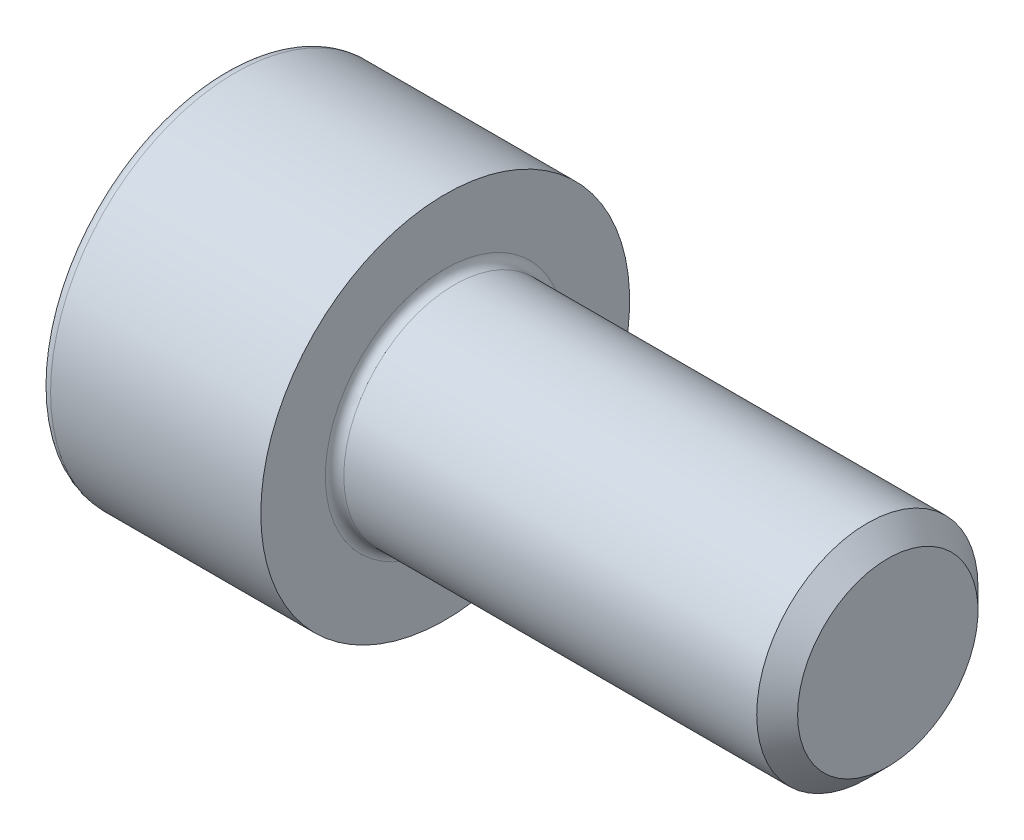
ISO-10303-21;
HEADER;
FILE_DESCRIPTION(('STEP AP214'),'2;1');
FILE_NAME('part.step','',(''),(''),'','','');
FILE_SCHEMA(('AUTOMOTIVE_DESIGN { 1 0 10303 214 1 1 1 1 }'));
ENDSEC;
DATA;
#1=APPLICATION_CONTEXT('core data for automotive mechanical design processes');
#2=APPLICATION_PROTOCOL_DEFINITION('international standard','automotive_design',2000,#1);
#3=PRODUCT_CONTEXT('',#1,'mechanical');
#4=PRODUCT('Part','Part','',(#3));
#5=PRODUCT_RELATED_PRODUCT_CATEGORY('part','',(#4));
#6=PRODUCT_DEFINITION_FORMATION('','',#4);
#7=PRODUCT_DEFINITION_CONTEXT('part definition',#1,'design');
#8=PRODUCT_DEFINITION('design','',#6,#7);
#9=PRODUCT_DEFINITION_SHAPE('','',#8);
#10=(LENGTH_UNIT() NAMED_UNIT(*) SI_UNIT(.MILLI.,.METRE.));
#11=(NAMED_UNIT(*) PLANE_ANGLE_UNIT() SI_UNIT($,.RADIAN.));
#12=(NAMED_UNIT(*) SI_UNIT($,.STERADIAN.) SOLID_ANGLE_UNIT());
#13=UNCERTAINTY_MEASURE_WITH_UNIT(LENGTH_MEASURE(1.E-05),#10,'distance_accuracy_value','');
#14=(GEOMETRIC_REPRESENTATION_CONTEXT(3) GLOBAL_UNCERTAINTY_ASSIGNED_CONTEXT((#13)) GLOBAL_UNIT_ASSIGNED_CONTEXT((#10,
#11,#12)) REPRESENTATION_CONTEXT('',''));
#15=CARTESIAN_POINT('',(0.,0.,0.));
#16=DIRECTION('',(0.,0.,1.));
#17=DIRECTION('',(1.,0.,0.));
#18=AXIS2_PLACEMENT_3D('',#15,#16,#17);
#19=CARTESIAN_POINT('',(0.,0.,0.));
#20=DIRECTION('',(-1.,0.,0.));
#21=DIRECTION('',(0.,0.,1.));
#22=AXIS2_PLACEMENT_3D('',#19,#20,#21);
#23=PLANE('',#22);
#24=DIRECTION('',(0.,-0.499999999999999,0.866025403784439));
#25=VECTOR('',#24,1.);
#26=CARTESIAN_POINT('',(0.,2.93524876856006,0.));
#27=LINE('',#26,#25);
#28=CARTESIAN_POINT('',(0.,2.93524876856006,0.));
#29=VERTEX_POINT('',#28);
#30=CARTESIAN_POINT('',(0.,1.46762438428003,2.542));
#31=VERTEX_POINT('',#30);
#32=EDGE_CURVE('E262',#29,#31,#27,.T.);
#33=ORIENTED_EDGE('',*,*,#32,.T.);
#34=DIRECTION('',(0.,1.,0.));
#35=VECTOR('',#34,1.);
#36=CARTESIAN_POINT('',(0.,-1.46762438428003,2.542));
#37=LINE('',#36,#35);
#38=CARTESIAN_POINT('',(0.,-1.46762438428003,2.542));
#39=VERTEX_POINT('',#38);
#40=EDGE_CURVE('E134',#39,#31,#37,.T.);
#41=ORIENTED_EDGE('',*,*,#40,.F.);
#42=DIRECTION('',(0.,-0.500000000000001,-0.866025403784438));
#43=VECTOR('',#42,1.);
#44=CARTESIAN_POINT('',(0.,-1.46762438428003,2.542));
#45=LINE('',#44,#43);
#46=CARTESIAN_POINT('',(0.,-2.93524876856006,0.));
#47=VERTEX_POINT('',#46);
#48=EDGE_CURVE('E265',#39,#47,#45,.T.);
#49=ORIENTED_EDGE('',*,*,#48,.T.);
#50=DIRECTION('',(0.,0.499999999999999,-0.866025403784439));
#51=VECTOR('',#50,1.);
#52=CARTESIAN_POINT('',(0.,-2.93524876856006,0.));
#53=LINE('',#52,#51);
#54=CARTESIAN_POINT('',(0.,-1.46762438428004,-2.542));
#55=VERTEX_POINT('',#54);
#56=EDGE_CURVE('E268',#47,#55,#53,.T.);
#57=ORIENTED_EDGE('',*,*,#56,.T.);
#58=DIRECTION('',(0.,-1.,0.));
#59=VECTOR('',#58,1.);
#60=CARTESIAN_POINT('',(0.,1.46762438428002,-2.542));
#61=LINE('',#60,#59);
#62=CARTESIAN_POINT('',(0.,1.46762438428002,-2.542));
#63=VERTEX_POINT('',#62);
#64=EDGE_CURVE('E271',#63,#55,#61,.T.);
#65=ORIENTED_EDGE('',*,*,#64,.F.);
#66=DIRECTION('',(0.,-0.500000000000001,-0.866025403784438));
#67=VECTOR('',#66,1.);
#68=CARTESIAN_POINT('',(0.,2.93524876856006,0.));
#69=LINE('',#68,#67);
#70=EDGE_CURVE('E129',#29,#63,#69,.T.);
#71=ORIENTED_EDGE('',*,*,#70,.F.);
#72=EDGE_LOOP('',(#33,#41,#49,#57,#65,#71));
#73=FACE_BOUND('',#72,.T.);
#74=CARTESIAN_POINT('',(0.,0.,0.));
#75=DIRECTION('',(-1.,0.,0.));
#76=DIRECTION('',(0.,0.,1.));
#77=AXIS2_PLACEMENT_3D('',#74,#75,#76);
#78=CIRCLE('',#77,4.7);
#79=CARTESIAN_POINT('',(0.,0.,4.7));
#80=VERTEX_POINT('',#79);
#81=EDGE_CURVE('E46',#80,#80,#78,.T.);
#82=ORIENTED_EDGE('',*,*,#81,.T.);
#83=EDGE_LOOP('',(#82));
#84=FACE_BOUND('',#83,.T.);
#85=ADVANCED_FACE('F38',(#73,#84),#23,.T.);
#86=CARTESIAN_POINT('',(-31.75,0.,0.));
#87=DIRECTION('',(-1.,0.,0.));
#88=DIRECTION('',(0.,0.,1.));
#89=AXIS2_PLACEMENT_3D('',#86,#87,#88);
#90=CYLINDRICAL_SURFACE('',#89,5.);
#91=CARTESIAN_POINT('',(0.300000000000002,0.,0.));
#92=DIRECTION('',(-1.,0.,0.));
#93=DIRECTION('',(0.,0.,1.));
#94=AXIS2_PLACEMENT_3D('',#91,#92,#93);
#95=CIRCLE('',#94,5.);
#96=CARTESIAN_POINT('',(0.300000000000002,0.,5.));
#97=VERTEX_POINT('',#96);
#98=EDGE_CURVE('E11',#97,#97,#95,.F.);
#99=ORIENTED_EDGE('',*,*,#98,.T.);
#100=EDGE_LOOP('',(#99));
#101=FACE_BOUND('',#100,.T.);
#102=CARTESIAN_POINT('',(6.,0.,0.));
#103=DIRECTION('',(-1.,0.,0.));
#104=DIRECTION('',(0.,0.,1.));
#105=AXIS2_PLACEMENT_3D('',#102,#103,#104);
#106=CIRCLE('',#105,5.);
#107=CARTESIAN_POINT('',(6.,0.,5.));
#108=VERTEX_POINT('',#107);
#109=EDGE_CURVE('E152',#108,#108,#106,.T.);
#110=ORIENTED_EDGE('',*,*,#109,.T.);
#111=EDGE_LOOP('',(#110));
#112=FACE_BOUND('',#111,.T.);
#113=ADVANCED_FACE('F176',(#101,#112),#90,.T.);
#114=CARTESIAN_POINT('',(6.,5.,0.));
#115=DIRECTION('',(1.,0.,0.));
#116=DIRECTION('',(0.,0.,-1.));
#117=AXIS2_PLACEMENT_3D('',#114,#115,#116);
#118=PLANE('',#117);
#119=CARTESIAN_POINT('',(6.,0.,0.));
#120=DIRECTION('',(1.,0.,0.));
#121=DIRECTION('',(0.,0.,-1.));
#122=AXIS2_PLACEMENT_3D('',#119,#120,#121);
#123=CIRCLE('',#122,3.24999999999998);
#124=CARTESIAN_POINT('',(6.,0.,-3.24999999999998));
#125=VERTEX_POINT('',#124);
#126=EDGE_CURVE('E155',#125,#125,#123,.F.);
#127=ORIENTED_EDGE('',*,*,#126,.T.);
#128=EDGE_LOOP('',(#127));
#129=FACE_BOUND('',#128,.T.);
#130=ORIENTED_EDGE('',*,*,#109,.F.);
#131=EDGE_LOOP('',(#130));
#132=FACE_BOUND('',#131,.T.);
#133=ADVANCED_FACE('F182',(#129,#132),#118,.T.);
#134=CARTESIAN_POINT('',(-31.75,0.,0.));
#135=DIRECTION('',(-1.,0.,0.));
#136=DIRECTION('',(0.,0.,1.));
#137=AXIS2_PLACEMENT_3D('',#134,#135,#136);
#138=CYLINDRICAL_SURFACE('',#137,2.99999999999998);
#139=CARTESIAN_POINT('',(6.25,0.,0.));
#140=DIRECTION('',(1.,0.,0.));
#141=DIRECTION('',(0.,0.,-1.));
#142=AXIS2_PLACEMENT_3D('',#139,#140,#141);
#143=CIRCLE('',#142,2.99999999999998);
#144=CARTESIAN_POINT('',(6.25,0.,-2.99999999999998));
#145=VERTEX_POINT('',#144);
#146=EDGE_CURVE('E158',#145,#145,#143,.T.);
#147=ORIENTED_EDGE('',*,*,#146,.T.);
#148=EDGE_LOOP('',(#147));
#149=FACE_BOUND('',#148,.T.);
#150=CARTESIAN_POINT('',(17.4455,0.,0.));
#151=DIRECTION('',(-1.,0.,0.));
#152=DIRECTION('',(0.,0.,1.));
#153=AXIS2_PLACEMENT_3D('',#150,#151,#152);
#154=CIRCLE('',#153,2.99999999999996);
#155=CARTESIAN_POINT('',(17.4455,0.,2.99999999999996));
#156=VERTEX_POINT('',#155);
#157=EDGE_CURVE('E149',#156,#156,#154,.T.);
#158=ORIENTED_EDGE('',*,*,#157,.T.);
#159=EDGE_LOOP('',(#158));
#160=FACE_BOUND('',#159,.T.);
#161=ADVANCED_FACE('F188',(#149,#160),#138,.T.);
#162=CARTESIAN_POINT('',(18.,0.,0.));
#163=DIRECTION('',(-1.,0.,0.));
#164=DIRECTION('',(0.,0.,1.));
#165=AXIS2_PLACEMENT_3D('',#162,#163,#164);
#166=CONICAL_SURFACE('',#165,2.4455,0.785398163397383);
#167=ORIENTED_EDGE('',*,*,#157,.F.);
#168=EDGE_LOOP('',(#167));
#169=FACE_BOUND('',#168,.T.);
#170=CARTESIAN_POINT('',(18.,0.,0.));
#171=DIRECTION('',(-1.,0.,0.));
#172=DIRECTION('',(0.,0.,1.));
#173=AXIS2_PLACEMENT_3D('',#170,#171,#172);
#174=CIRCLE('',#173,2.4455);
#175=CARTESIAN_POINT('',(18.,0.,2.4455));
#176=VERTEX_POINT('',#175);
#177=EDGE_CURVE('E145',#176,#176,#174,.T.);
#178=ORIENTED_EDGE('',*,*,#177,.T.);
#179=EDGE_LOOP('',(#178));
#180=FACE_BOUND('',#179,.T.);
#181=ADVANCED_FACE('F192',(#169,#180),#166,.T.);
#182=CARTESIAN_POINT('',(18.,2.4455,0.));
#183=DIRECTION('',(1.,0.,0.));
#184=DIRECTION('',(0.,0.,-1.));
#185=AXIS2_PLACEMENT_3D('',#182,#183,#184);
#186=PLANE('',#185);
#187=ORIENTED_EDGE('',*,*,#177,.F.);
#188=EDGE_LOOP('',(#187));
#189=FACE_BOUND('',#188,.T.);
#190=ADVANCED_FACE('F172',(#189),#186,.T.);
#191=CARTESIAN_POINT('',(6.25,0.,0.));
#192=DIRECTION('',(1.,0.,0.));
#193=DIRECTION('',(0.,0.,-1.));
#194=AXIS2_PLACEMENT_3D('',#191,#192,#193);
#195=TOROIDAL_SURFACE('',#194,3.24999999999998,0.25);
#196=ORIENTED_EDGE('',*,*,#146,.F.);
#197=EDGE_LOOP('',(#196));
#198=FACE_BOUND('',#197,.T.);
#199=ORIENTED_EDGE('',*,*,#126,.F.);
#200=EDGE_LOOP('',(#199));
#201=FACE_BOUND('',#200,.T.);
#202=ADVANCED_FACE('F165',(#198,#201),#195,.F.);
#203=CARTESIAN_POINT('',(0.300000000000002,0.,0.));
#204=DIRECTION('',(-1.,0.,0.));
#205=DIRECTION('',(0.,0.,1.));
#206=AXIS2_PLACEMENT_3D('',#203,#204,#205);
#207=TOROIDAL_SURFACE('',#206,4.7,0.3);
#208=ORIENTED_EDGE('',*,*,#98,.F.);
#209=EDGE_LOOP('',(#208));
#210=FACE_BOUND('',#209,.T.);
#211=ORIENTED_EDGE('',*,*,#81,.F.);
#212=EDGE_LOOP('',(#211));
#213=FACE_BOUND('',#212,.T.);
#214=ADVANCED_FACE('F40',(#210,#213),#207,.T.);
#215=CARTESIAN_POINT('',(3.,2.93524876856006,0.));
#216=DIRECTION('',(0.,-0.866025403784439,-0.499999999999999));
#217=DIRECTION('',(0.,0.499999999999999,-0.866025403784439));
#218=AXIS2_PLACEMENT_3D('',#215,#216,#217);
#219=PLANE('',#218);
#220=ORIENTED_EDGE('',*,*,#32,.F.);
#221=DIRECTION('',(-1.,0.,0.));
#222=VECTOR('',#221,1.);
#223=CARTESIAN_POINT('',(3.,2.93524876856006,0.));
#224=LINE('',#223,#222);
#225=CARTESIAN_POINT('',(3.,2.93524876856006,0.));
#226=VERTEX_POINT('',#225);
#227=EDGE_CURVE('E252',#226,#29,#224,.T.);
#228=ORIENTED_EDGE('',*,*,#227,.F.);
#229=DIRECTION('',(0.,-0.499999999999999,0.866025403784439));
#230=VECTOR('',#229,1.);
#231=CARTESIAN_POINT('',(3.,2.93524876856006,0.));
#232=LINE('',#231,#230);
#233=CARTESIAN_POINT('',(3.,2.20143657642004,1.271));
#234=VERTEX_POINT('',#233);
#235=EDGE_CURVE('E121',#226,#234,#232,.T.);
#236=ORIENTED_EDGE('',*,*,#235,.T.);
#237=CARTESIAN_POINT('',(3.,1.46762438428003,2.542));
#238=VERTEX_POINT('',#237);
#239=EDGE_CURVE('E112',#234,#238,#232,.T.);
#240=ORIENTED_EDGE('',*,*,#239,.T.);
#241=DIRECTION('',(-1.,0.,0.));
#242=VECTOR('',#241,1.);
#243=CARTESIAN_POINT('',(3.,1.46762438428003,2.542));
#244=LINE('',#243,#242);
#245=EDGE_CURVE('E126',#238,#31,#244,.T.);
#246=ORIENTED_EDGE('',*,*,#245,.T.);
#247=EDGE_LOOP('',(#220,#228,#236,#240,#246));
#248=FACE_BOUND('',#247,.T.);
#249=ADVANCED_FACE('F125',(#248),#219,.T.);
#250=CARTESIAN_POINT('',(3.,-1.46762438428003,2.542));
#251=DIRECTION('',(0.,0.,1.));
#252=DIRECTION('',(0.,-1.,0.));
#253=AXIS2_PLACEMENT_3D('',#250,#251,#252);
#254=PLANE('',#253);
#255=ORIENTED_EDGE('',*,*,#40,.T.);
#256=ORIENTED_EDGE('',*,*,#245,.F.);
#257=DIRECTION('',(0.,1.,0.));
#258=VECTOR('',#257,1.);
#259=CARTESIAN_POINT('',(3.,-1.46762438428003,2.542));
#260=LINE('',#259,#258);
#261=CARTESIAN_POINT('',(3.,0.,2.542));
#262=VERTEX_POINT('',#261);
#263=EDGE_CURVE('E109',#262,#238,#260,.T.);
#264=ORIENTED_EDGE('',*,*,#263,.F.);
#265=CARTESIAN_POINT('',(3.,-1.46762438428003,2.542));
#266=VERTEX_POINT('',#265);
#267=EDGE_CURVE('E120',#266,#262,#260,.T.);
#268=ORIENTED_EDGE('',*,*,#267,.F.);
#269=DIRECTION('',(-1.,0.,0.));
#270=VECTOR('',#269,1.);
#271=CARTESIAN_POINT('',(3.,-1.46762438428003,2.542));
#272=LINE('',#271,#270);
#273=EDGE_CURVE('E136',#266,#39,#272,.T.);
#274=ORIENTED_EDGE('',*,*,#273,.T.);
#275=EDGE_LOOP('',(#255,#256,#264,#268,#274));
#276=FACE_BOUND('',#275,.T.);
#277=ADVANCED_FACE('F131',(#276),#254,.F.);
#278=CARTESIAN_POINT('',(3.,-1.46762438428003,2.542));
#279=DIRECTION('',(0.,0.866025403784438,-0.500000000000001));
#280=DIRECTION('',(0.,0.500000000000001,0.866025403784438));
#281=AXIS2_PLACEMENT_3D('',#278,#279,#280);
#282=PLANE('',#281);
#283=ORIENTED_EDGE('',*,*,#48,.F.);
#284=ORIENTED_EDGE('',*,*,#273,.F.);
#285=DIRECTION('',(0.,-0.500000000000001,-0.866025403784438));
#286=VECTOR('',#285,1.);
#287=CARTESIAN_POINT('',(3.,-1.46762438428003,2.542));
#288=LINE('',#287,#286);
#289=CARTESIAN_POINT('',(3.,-2.20143657642004,1.271));
#290=VERTEX_POINT('',#289);
#291=EDGE_CURVE('E291',#266,#290,#288,.T.);
#292=ORIENTED_EDGE('',*,*,#291,.T.);
#293=CARTESIAN_POINT('',(3.,-2.93524876856006,0.));
#294=VERTEX_POINT('',#293);
#295=EDGE_CURVE('E280',#290,#294,#288,.T.);
#296=ORIENTED_EDGE('',*,*,#295,.T.);
#297=DIRECTION('',(-1.,0.,0.));
#298=VECTOR('',#297,1.);
#299=CARTESIAN_POINT('',(3.,-2.93524876856006,0.));
#300=LINE('',#299,#298);
#301=EDGE_CURVE('E141',#294,#47,#300,.T.);
#302=ORIENTED_EDGE('',*,*,#301,.T.);
#303=EDGE_LOOP('',(#283,#284,#292,#296,#302));
#304=FACE_BOUND('',#303,.T.);
#305=ADVANCED_FACE('F206',(#304),#282,.T.);
#306=CARTESIAN_POINT('',(3.,-2.93524876856006,0.));
#307=DIRECTION('',(0.,0.866025403784439,0.499999999999999));
#308=DIRECTION('',(0.,-0.499999999999999,0.866025403784439));
#309=AXIS2_PLACEMENT_3D('',#306,#307,#308);
#310=PLANE('',#309);
#311=ORIENTED_EDGE('',*,*,#56,.F.);
#312=ORIENTED_EDGE('',*,*,#301,.F.);
#313=DIRECTION('',(0.,0.499999999999999,-0.866025403784439));
#314=VECTOR('',#313,1.);
#315=CARTESIAN_POINT('',(3.,-2.93524876856006,0.));
#316=LINE('',#315,#314);
#317=CARTESIAN_POINT('',(3.,-2.20143657642005,-1.271));
#318=VERTEX_POINT('',#317);
#319=EDGE_CURVE('E258',#294,#318,#316,.T.);
#320=ORIENTED_EDGE('',*,*,#319,.T.);
#321=CARTESIAN_POINT('',(3.,-1.46762438428004,-2.542));
#322=VERTEX_POINT('',#321);
#323=EDGE_CURVE('E290',#318,#322,#316,.T.);
#324=ORIENTED_EDGE('',*,*,#323,.T.);
#325=DIRECTION('',(-1.,0.,0.));
#326=VECTOR('',#325,1.);
#327=CARTESIAN_POINT('',(3.,-1.46762438428004,-2.542));
#328=LINE('',#327,#326);
#329=EDGE_CURVE('E251',#322,#55,#328,.T.);
#330=ORIENTED_EDGE('',*,*,#329,.T.);
#331=EDGE_LOOP('',(#311,#312,#320,#324,#330));
#332=FACE_BOUND('',#331,.T.);
#333=ADVANCED_FACE('F209',(#332),#310,.T.);
#334=CARTESIAN_POINT('',(3.,1.46762438428002,-2.542));
#335=DIRECTION('',(0.,0.,-1.));
#336=DIRECTION('',(0.,1.,0.));
#337=AXIS2_PLACEMENT_3D('',#334,#335,#336);
#338=PLANE('',#337);
#339=ORIENTED_EDGE('',*,*,#64,.T.);
#340=ORIENTED_EDGE('',*,*,#329,.F.);
#341=DIRECTION('',(0.,-1.,0.));
#342=VECTOR('',#341,1.);
#343=CARTESIAN_POINT('',(3.,1.46762438428002,-2.542));
#344=LINE('',#343,#342);
#345=CARTESIAN_POINT('',(3.,0.,-2.542));
#346=VERTEX_POINT('',#345);
#347=EDGE_CURVE('E255',#346,#322,#344,.T.);
#348=ORIENTED_EDGE('',*,*,#347,.F.);
#349=CARTESIAN_POINT('',(3.,1.46762438428002,-2.542));
#350=VERTEX_POINT('',#349);
#351=EDGE_CURVE('E53',#350,#346,#344,.T.);
#352=ORIENTED_EDGE('',*,*,#351,.F.);
#353=DIRECTION('',(-1.,0.,0.));
#354=VECTOR('',#353,1.);
#355=CARTESIAN_POINT('',(3.,1.46762438428002,-2.542));
#356=LINE('',#355,#354);
#357=EDGE_CURVE('E248',#350,#63,#356,.T.);
#358=ORIENTED_EDGE('',*,*,#357,.T.);
#359=EDGE_LOOP('',(#339,#340,#348,#352,#358));
#360=FACE_BOUND('',#359,.T.);
#361=ADVANCED_FACE('F213',(#360),#338,.F.);
#362=CARTESIAN_POINT('',(3.,2.93524876856006,0.));
#363=DIRECTION('',(0.,0.866025403784438,-0.500000000000001));
#364=DIRECTION('',(0.,0.500000000000001,0.866025403784438));
#365=AXIS2_PLACEMENT_3D('',#362,#363,#364);
#366=PLANE('',#365);
#367=ORIENTED_EDGE('',*,*,#70,.T.);
#368=ORIENTED_EDGE('',*,*,#357,.F.);
#369=DIRECTION('',(0.,-0.500000000000001,-0.866025403784438));
#370=VECTOR('',#369,1.);
#371=CARTESIAN_POINT('',(3.,2.93524876856006,0.));
#372=LINE('',#371,#370);
#373=CARTESIAN_POINT('',(3.,2.20143657642004,-1.271));
#374=VERTEX_POINT('',#373);
#375=EDGE_CURVE('E238',#374,#350,#372,.T.);
#376=ORIENTED_EDGE('',*,*,#375,.F.);
#377=EDGE_CURVE('E244',#226,#374,#372,.T.);
#378=ORIENTED_EDGE('',*,*,#377,.F.);
#379=ORIENTED_EDGE('',*,*,#227,.T.);
#380=EDGE_LOOP('',(#367,#368,#376,#378,#379));
#381=FACE_BOUND('',#380,.T.);
#382=ADVANCED_FACE('F217',(#381),#366,.F.);
#383=CARTESIAN_POINT('',(3.,2.93524876856006,0.));
#384=DIRECTION('',(1.,0.,0.));
#385=DIRECTION('',(0.,0.,-1.));
#386=AXIS2_PLACEMENT_3D('',#383,#384,#385);
#387=PLANE('',#386);
#388=ORIENTED_EDGE('',*,*,#347,.T.);
#389=ORIENTED_EDGE('',*,*,#323,.F.);
#390=CARTESIAN_POINT('',(3.,0.,0.));
#391=DIRECTION('',(-1.,0.,0.));
#392=DIRECTION('',(0.,0.,1.));
#393=AXIS2_PLACEMENT_3D('',#390,#391,#392);
#394=CIRCLE('',#393,2.542);
#395=EDGE_CURVE('E286',#346,#318,#394,.T.);
#396=ORIENTED_EDGE('',*,*,#395,.F.);
#397=EDGE_LOOP('',(#388,#389,#396));
#398=FACE_BOUND('',#397,.T.);
#399=ADVANCED_FACE('F221',(#398),#387,.F.);
#400=ORIENTED_EDGE('',*,*,#319,.F.);
#401=ORIENTED_EDGE('',*,*,#295,.F.);
#402=EDGE_CURVE('E139',#318,#290,#394,.T.);
#403=ORIENTED_EDGE('',*,*,#402,.F.);
#404=EDGE_LOOP('',(#400,#401,#403));
#405=FACE_BOUND('',#404,.T.);
#406=ADVANCED_FACE('F224',(#405),#387,.F.);
#407=ORIENTED_EDGE('',*,*,#291,.F.);
#408=ORIENTED_EDGE('',*,*,#267,.T.);
#409=EDGE_CURVE('E135',#290,#262,#394,.T.);
#410=ORIENTED_EDGE('',*,*,#409,.F.);
#411=EDGE_LOOP('',(#407,#408,#410));
#412=FACE_BOUND('',#411,.T.);
#413=ADVANCED_FACE('F229',(#412),#387,.F.);
#414=ORIENTED_EDGE('',*,*,#263,.T.);
#415=ORIENTED_EDGE('',*,*,#239,.F.);
#416=EDGE_CURVE('E115',#262,#234,#394,.T.);
#417=ORIENTED_EDGE('',*,*,#416,.F.);
#418=EDGE_LOOP('',(#414,#415,#417));
#419=FACE_BOUND('',#418,.T.);
#420=ADVANCED_FACE('F111',(#419),#387,.F.);
#421=ORIENTED_EDGE('',*,*,#235,.F.);
#422=ORIENTED_EDGE('',*,*,#377,.T.);
#423=EDGE_CURVE('E146',#234,#374,#394,.T.);
#424=ORIENTED_EDGE('',*,*,#423,.F.);
#425=EDGE_LOOP('',(#421,#422,#424));
#426=FACE_BOUND('',#425,.T.);
#427=ADVANCED_FACE('F232',(#426),#387,.F.);
#428=ORIENTED_EDGE('',*,*,#375,.T.);
#429=ORIENTED_EDGE('',*,*,#351,.T.);
#430=EDGE_CURVE('E241',#374,#346,#394,.T.);
#431=ORIENTED_EDGE('',*,*,#430,.F.);
#432=EDGE_LOOP('',(#428,#429,#431));
#433=FACE_BOUND('',#432,.T.);
#434=ADVANCED_FACE('F202',(#433),#387,.F.);
#435=CARTESIAN_POINT('',(3.,0.,0.));
#436=DIRECTION('',(-1.,0.,0.));
#437=DIRECTION('',(0.,0.,1.));
#438=AXIS2_PLACEMENT_3D('',#435,#436,#437);
#439=CONICAL_SURFACE('',#438,2.542,1.04719755119659);
#440=CARTESIAN_POINT('',(4.46762438428005,0.,0.));
#441=VERTEX_POINT('',#440);
#442=VERTEX_LOOP('',#441);
#443=FACE_BOUND('',#442,.T.);
#444=ORIENTED_EDGE('',*,*,#416,.T.);
#445=ORIENTED_EDGE('',*,*,#423,.T.);
#446=ORIENTED_EDGE('',*,*,#430,.T.);
#447=ORIENTED_EDGE('',*,*,#395,.T.);
#448=ORIENTED_EDGE('',*,*,#402,.T.);
#449=ORIENTED_EDGE('',*,*,#409,.T.);
#450=EDGE_LOOP('',(#444,#445,#446,#447,#448,#449));
#451=FACE_BOUND('',#450,.T.);
#452=ADVANCED_FACE('F200',(#443,#451),#439,.F.);
#453=CLOSED_SHELL('',(#85,#113,#133,#161,#181,#190,#202,#214,#249,#277,#305,#333,#361,#382,#399,
#406,#413,#420,#427,#434,#452));
#454=MANIFOLD_SOLID_BREP('B2',#453);
#455=ADVANCED_BREP_SHAPE_REPRESENTATION('',(#18,#454),#14);
#456=SHAPE_DEFINITION_REPRESENTATION(#9,#455);
ENDSEC;
END-ISO-10303-21;
